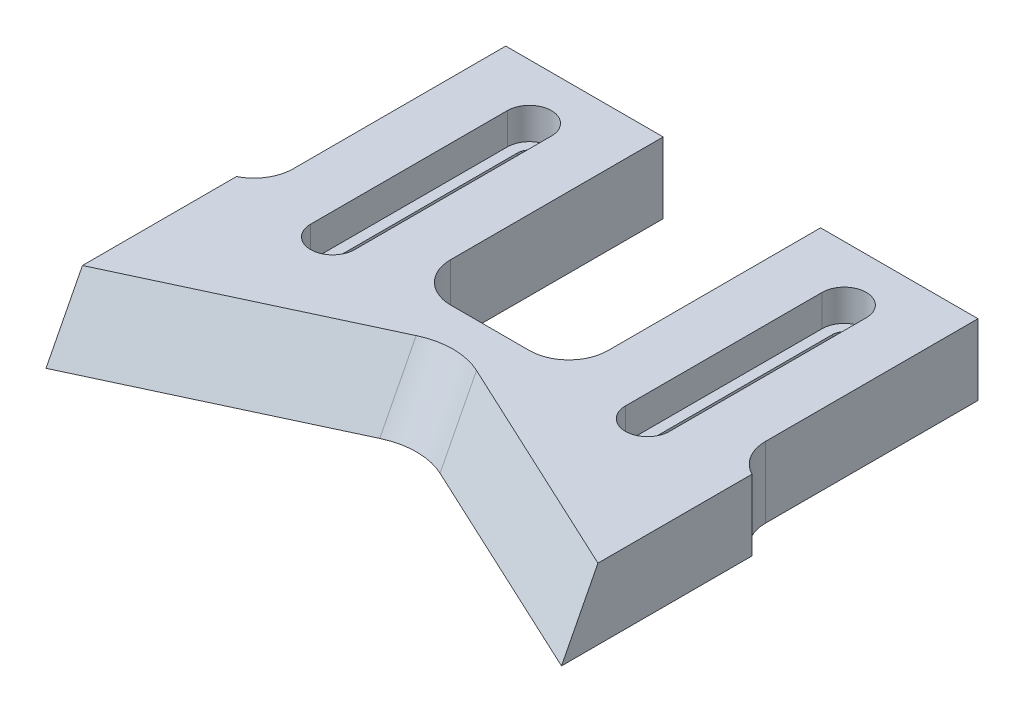
ISO-10303-21;
HEADER;
FILE_DESCRIPTION(('STEP AP214'),'2;1');
FILE_NAME('part.step','',(''),(''),'','','');
FILE_SCHEMA(('AUTOMOTIVE_DESIGN { 1 0 10303 214 1 1 1 1 }'));
ENDSEC;
DATA;
#1=APPLICATION_CONTEXT('core data for automotive mechanical design processes');
#2=APPLICATION_PROTOCOL_DEFINITION('international standard','automotive_design',2000,#1);
#3=PRODUCT_CONTEXT('',#1,'mechanical');
#4=PRODUCT('Part','Part','',(#3));
#5=PRODUCT_RELATED_PRODUCT_CATEGORY('part','',(#4));
#6=PRODUCT_DEFINITION_FORMATION('','',#4);
#7=PRODUCT_DEFINITION_CONTEXT('part definition',#1,'design');
#8=PRODUCT_DEFINITION('design','',#6,#7);
#9=PRODUCT_DEFINITION_SHAPE('','',#8);
#10=(LENGTH_UNIT() NAMED_UNIT(*) SI_UNIT(.MILLI.,.METRE.));
#11=(NAMED_UNIT(*) PLANE_ANGLE_UNIT() SI_UNIT($,.RADIAN.));
#12=(NAMED_UNIT(*) SI_UNIT($,.STERADIAN.) SOLID_ANGLE_UNIT());
#13=UNCERTAINTY_MEASURE_WITH_UNIT(LENGTH_MEASURE(1.E-05),#10,'distance_accuracy_value','');
#14=(GEOMETRIC_REPRESENTATION_CONTEXT(3) GLOBAL_UNCERTAINTY_ASSIGNED_CONTEXT((#13)) GLOBAL_UNIT_ASSIGNED_CONTEXT((#10,
#11,#12)) REPRESENTATION_CONTEXT('',''));
#15=CARTESIAN_POINT('',(0.,0.,0.));
#16=DIRECTION('',(0.,0.,1.));
#17=DIRECTION('',(1.,0.,0.));
#18=AXIS2_PLACEMENT_3D('',#15,#16,#17);
#19=CARTESIAN_POINT('',(57.75,-0.000999999999999265,-51.));
#20=DIRECTION('',(0.,1.,0.));
#21=DIRECTION('',(0.,0.,1.));
#22=AXIS2_PLACEMENT_3D('',#19,#20,#21);
#23=CYLINDRICAL_SURFACE('',#22,1.5);
#24=CARTESIAN_POINT('',(57.75,5.,-51.));
#25=DIRECTION('',(0.,1.,0.));
#26=DIRECTION('',(0.,0.,1.));
#27=AXIS2_PLACEMENT_3D('',#24,#25,#26);
#28=CIRCLE('',#27,1.5);
#29=CARTESIAN_POINT('',(56.25,5.,-51.));
#30=VERTEX_POINT('',#29);
#31=CARTESIAN_POINT('',(59.25,5.,-51.));
#32=VERTEX_POINT('',#31);
#33=EDGE_CURVE('E388',#30,#32,#28,.F.);
#34=ORIENTED_EDGE('',*,*,#33,.F.);
#35=DIRECTION('',(0.,1.,0.));
#36=VECTOR('',#35,1.);
#37=CARTESIAN_POINT('',(56.25,-0.000999999999999265,-51.));
#38=LINE('',#37,#36);
#39=CARTESIAN_POINT('',(56.25,0.,-51.));
#40=VERTEX_POINT('',#39);
#41=EDGE_CURVE('E460',#40,#30,#38,.T.);
#42=ORIENTED_EDGE('',*,*,#41,.F.);
#43=CARTESIAN_POINT('',(57.75,0.,-51.));
#44=DIRECTION('',(0.,-1.,0.));
#45=DIRECTION('',(0.,0.,-1.));
#46=AXIS2_PLACEMENT_3D('',#43,#44,#45);
#47=CIRCLE('',#46,1.5);
#48=CARTESIAN_POINT('',(59.25,0.,-51.));
#49=VERTEX_POINT('',#48);
#50=EDGE_CURVE('E457',#49,#40,#47,.F.);
#51=ORIENTED_EDGE('',*,*,#50,.F.);
#52=DIRECTION('',(0.,1.,0.));
#53=VECTOR('',#52,1.);
#54=CARTESIAN_POINT('',(59.25,-0.000999999999999265,-51.));
#55=LINE('',#54,#53);
#56=EDGE_CURVE('E461',#49,#32,#55,.T.);
#57=ORIENTED_EDGE('',*,*,#56,.T.);
#58=EDGE_LOOP('',(#34,#42,#51,#57));
#59=FACE_BOUND('',#58,.T.);
#60=ADVANCED_FACE('F37',(#59),#23,.F.);
#61=CARTESIAN_POINT('',(59.25,-0.000999999999999265,-51.));
#62=DIRECTION('',(1.,0.,0.));
#63=DIRECTION('',(0.,0.,-1.));
#64=AXIS2_PLACEMENT_3D('',#61,#62,#63);
#65=PLANE('',#64);
#66=DIRECTION('',(0.,0.,1.));
#67=VECTOR('',#66,1.);
#68=CARTESIAN_POINT('',(59.25,5.,-51.));
#69=LINE('',#68,#67);
#70=CARTESIAN_POINT('',(59.25,5.,-26.));
#71=VERTEX_POINT('',#70);
#72=EDGE_CURVE('E386',#32,#71,#69,.T.);
#73=ORIENTED_EDGE('',*,*,#72,.F.);
#74=ORIENTED_EDGE('',*,*,#56,.F.);
#75=DIRECTION('',(0.,0.,-1.));
#76=VECTOR('',#75,1.);
#77=CARTESIAN_POINT('',(59.25,0.,-51.));
#78=LINE('',#77,#76);
#79=CARTESIAN_POINT('',(59.25,0.,-26.));
#80=VERTEX_POINT('',#79);
#81=EDGE_CURVE('E454',#80,#49,#78,.T.);
#82=ORIENTED_EDGE('',*,*,#81,.F.);
#83=DIRECTION('',(0.,1.,0.));
#84=VECTOR('',#83,1.);
#85=CARTESIAN_POINT('',(59.25,-0.000999999999999265,-26.));
#86=LINE('',#85,#84);
#87=EDGE_CURVE('E465',#80,#71,#86,.T.);
#88=ORIENTED_EDGE('',*,*,#87,.T.);
#89=EDGE_LOOP('',(#73,#74,#82,#88));
#90=FACE_BOUND('',#89,.T.);
#91=ADVANCED_FACE('F530',(#90),#65,.F.);
#92=CARTESIAN_POINT('',(57.75,-0.000999999999999265,-26.));
#93=DIRECTION('',(0.,1.,0.));
#94=DIRECTION('',(0.,0.,1.));
#95=AXIS2_PLACEMENT_3D('',#92,#93,#94);
#96=CYLINDRICAL_SURFACE('',#95,1.5);
#97=CARTESIAN_POINT('',(57.75,5.,-26.));
#98=DIRECTION('',(0.,1.,0.));
#99=DIRECTION('',(0.,0.,1.));
#100=AXIS2_PLACEMENT_3D('',#97,#98,#99);
#101=CIRCLE('',#100,1.5);
#102=CARTESIAN_POINT('',(56.25,5.,-26.));
#103=VERTEX_POINT('',#102);
#104=EDGE_CURVE('E378',#71,#103,#101,.F.);
#105=ORIENTED_EDGE('',*,*,#104,.F.);
#106=ORIENTED_EDGE('',*,*,#87,.F.);
#107=CARTESIAN_POINT('',(57.75,0.,-26.));
#108=DIRECTION('',(0.,-1.,0.));
#109=DIRECTION('',(0.,0.,-1.));
#110=AXIS2_PLACEMENT_3D('',#107,#108,#109);
#111=CIRCLE('',#110,1.5);
#112=CARTESIAN_POINT('',(56.25,0.,-26.));
#113=VERTEX_POINT('',#112);
#114=EDGE_CURVE('E449',#113,#80,#111,.F.);
#115=ORIENTED_EDGE('',*,*,#114,.F.);
#116=DIRECTION('',(0.,1.,0.));
#117=VECTOR('',#116,1.);
#118=CARTESIAN_POINT('',(56.25,-0.000999999999999265,-26.));
#119=LINE('',#118,#117);
#120=EDGE_CURVE('E468',#113,#103,#119,.T.);
#121=ORIENTED_EDGE('',*,*,#120,.T.);
#122=EDGE_LOOP('',(#105,#106,#115,#121));
#123=FACE_BOUND('',#122,.T.);
#124=ADVANCED_FACE('F536',(#123),#96,.F.);
#125=CARTESIAN_POINT('',(56.25,-0.000999999999999265,-51.));
#126=DIRECTION('',(-1.,0.,0.));
#127=DIRECTION('',(0.,0.,1.));
#128=AXIS2_PLACEMENT_3D('',#125,#126,#127);
#129=PLANE('',#128);
#130=DIRECTION('',(0.,0.,-1.));
#131=VECTOR('',#130,1.);
#132=CARTESIAN_POINT('',(56.25,5.,-51.));
#133=LINE('',#132,#131);
#134=EDGE_CURVE('E327',#103,#30,#133,.T.);
#135=ORIENTED_EDGE('',*,*,#134,.F.);
#136=ORIENTED_EDGE('',*,*,#120,.F.);
#137=DIRECTION('',(0.,0.,1.));
#138=VECTOR('',#137,1.);
#139=CARTESIAN_POINT('',(56.25,0.,-51.));
#140=LINE('',#139,#138);
#141=EDGE_CURVE('E464',#40,#113,#140,.T.);
#142=ORIENTED_EDGE('',*,*,#141,.F.);
#143=ORIENTED_EDGE('',*,*,#41,.T.);
#144=EDGE_LOOP('',(#135,#136,#142,#143));
#145=FACE_BOUND('',#144,.T.);
#146=ADVANCED_FACE('F542',(#145),#129,.F.);
#147=CARTESIAN_POINT('',(17.75,-0.000999999999999265,-51.));
#148=DIRECTION('',(0.,1.,0.));
#149=DIRECTION('',(0.,0.,1.));
#150=AXIS2_PLACEMENT_3D('',#147,#148,#149);
#151=CYLINDRICAL_SURFACE('',#150,1.5);
#152=CARTESIAN_POINT('',(17.75,5.,-51.));
#153=DIRECTION('',(0.,1.,0.));
#154=DIRECTION('',(0.,0.,1.));
#155=AXIS2_PLACEMENT_3D('',#152,#153,#154);
#156=CIRCLE('',#155,1.5);
#157=CARTESIAN_POINT('',(16.25,5.,-51.));
#158=VERTEX_POINT('',#157);
#159=CARTESIAN_POINT('',(19.25,5.,-51.));
#160=VERTEX_POINT('',#159);
#161=EDGE_CURVE('E426',#158,#160,#156,.F.);
#162=ORIENTED_EDGE('',*,*,#161,.F.);
#163=DIRECTION('',(0.,1.,0.));
#164=VECTOR('',#163,1.);
#165=CARTESIAN_POINT('',(16.25,-0.000999999999999265,-51.));
#166=LINE('',#165,#164);
#167=CARTESIAN_POINT('',(16.25,0.,-51.));
#168=VERTEX_POINT('',#167);
#169=EDGE_CURVE('E484',#168,#158,#166,.T.);
#170=ORIENTED_EDGE('',*,*,#169,.F.);
#171=CARTESIAN_POINT('',(17.75,0.,-51.));
#172=DIRECTION('',(0.,-1.,0.));
#173=DIRECTION('',(0.,0.,-1.));
#174=AXIS2_PLACEMENT_3D('',#171,#172,#173);
#175=CIRCLE('',#174,1.5);
#176=CARTESIAN_POINT('',(19.25,0.,-51.));
#177=VERTEX_POINT('',#176);
#178=EDGE_CURVE('E481',#177,#168,#175,.F.);
#179=ORIENTED_EDGE('',*,*,#178,.F.);
#180=DIRECTION('',(0.,1.,0.));
#181=VECTOR('',#180,1.);
#182=CARTESIAN_POINT('',(19.25,-0.000999999999999265,-51.));
#183=LINE('',#182,#181);
#184=EDGE_CURVE('E485',#177,#160,#183,.T.);
#185=ORIENTED_EDGE('',*,*,#184,.T.);
#186=EDGE_LOOP('',(#162,#170,#179,#185));
#187=FACE_BOUND('',#186,.T.);
#188=ADVANCED_FACE('F548',(#187),#151,.F.);
#189=CARTESIAN_POINT('',(19.25,-0.000999999999999265,-51.));
#190=DIRECTION('',(1.,0.,0.));
#191=DIRECTION('',(0.,0.,-1.));
#192=AXIS2_PLACEMENT_3D('',#189,#190,#191);
#193=PLANE('',#192);
#194=DIRECTION('',(0.,0.,1.));
#195=VECTOR('',#194,1.);
#196=CARTESIAN_POINT('',(19.25,5.,-51.));
#197=LINE('',#196,#195);
#198=CARTESIAN_POINT('',(19.25,5.,-26.));
#199=VERTEX_POINT('',#198);
#200=EDGE_CURVE('E424',#160,#199,#197,.T.);
#201=ORIENTED_EDGE('',*,*,#200,.F.);
#202=ORIENTED_EDGE('',*,*,#184,.F.);
#203=DIRECTION('',(0.,0.,-1.));
#204=VECTOR('',#203,1.);
#205=CARTESIAN_POINT('',(19.25,0.,-51.));
#206=LINE('',#205,#204);
#207=CARTESIAN_POINT('',(19.25,0.,-26.));
#208=VERTEX_POINT('',#207);
#209=EDGE_CURVE('E478',#208,#177,#206,.T.);
#210=ORIENTED_EDGE('',*,*,#209,.F.);
#211=DIRECTION('',(0.,1.,0.));
#212=VECTOR('',#211,1.);
#213=CARTESIAN_POINT('',(19.25,-0.000999999999999265,-26.));
#214=LINE('',#213,#212);
#215=EDGE_CURVE('E488',#208,#199,#214,.T.);
#216=ORIENTED_EDGE('',*,*,#215,.T.);
#217=EDGE_LOOP('',(#201,#202,#210,#216));
#218=FACE_BOUND('',#217,.T.);
#219=ADVANCED_FACE('F544',(#218),#193,.F.);
#220=CARTESIAN_POINT('',(17.75,-0.000999999999999265,-26.));
#221=DIRECTION('',(0.,1.,0.));
#222=DIRECTION('',(0.,0.,1.));
#223=AXIS2_PLACEMENT_3D('',#220,#221,#222);
#224=CYLINDRICAL_SURFACE('',#223,1.5);
#225=CARTESIAN_POINT('',(17.75,5.,-26.));
#226=DIRECTION('',(0.,1.,0.));
#227=DIRECTION('',(0.,0.,1.));
#228=AXIS2_PLACEMENT_3D('',#225,#226,#227);
#229=CIRCLE('',#228,1.5);
#230=CARTESIAN_POINT('',(16.25,5.,-26.));
#231=VERTEX_POINT('',#230);
#232=EDGE_CURVE('E416',#199,#231,#229,.F.);
#233=ORIENTED_EDGE('',*,*,#232,.F.);
#234=ORIENTED_EDGE('',*,*,#215,.F.);
#235=CARTESIAN_POINT('',(17.75,0.,-26.));
#236=DIRECTION('',(0.,-1.,0.));
#237=DIRECTION('',(0.,0.,-1.));
#238=AXIS2_PLACEMENT_3D('',#235,#236,#237);
#239=CIRCLE('',#238,1.5);
#240=CARTESIAN_POINT('',(16.25,0.,-26.));
#241=VERTEX_POINT('',#240);
#242=EDGE_CURVE('E475',#241,#208,#239,.F.);
#243=ORIENTED_EDGE('',*,*,#242,.F.);
#244=DIRECTION('',(0.,1.,0.));
#245=VECTOR('',#244,1.);
#246=CARTESIAN_POINT('',(16.25,-0.000999999999999265,-26.));
#247=LINE('',#246,#245);
#248=EDGE_CURVE('E491',#241,#231,#247,.T.);
#249=ORIENTED_EDGE('',*,*,#248,.T.);
#250=EDGE_LOOP('',(#233,#234,#243,#249));
#251=FACE_BOUND('',#250,.T.);
#252=ADVANCED_FACE('F547',(#251),#224,.F.);
#253=CARTESIAN_POINT('',(16.25,-0.000999999999999265,-51.));
#254=DIRECTION('',(-1.,0.,0.));
#255=DIRECTION('',(0.,0.,1.));
#256=AXIS2_PLACEMENT_3D('',#253,#254,#255);
#257=PLANE('',#256);
#258=DIRECTION('',(0.,0.,-1.));
#259=VECTOR('',#258,1.);
#260=CARTESIAN_POINT('',(16.25,5.,-51.));
#261=LINE('',#260,#259);
#262=EDGE_CURVE('E325',#231,#158,#261,.T.);
#263=ORIENTED_EDGE('',*,*,#262,.F.);
#264=ORIENTED_EDGE('',*,*,#248,.F.);
#265=DIRECTION('',(0.,0.,1.));
#266=VECTOR('',#265,1.);
#267=CARTESIAN_POINT('',(16.25,0.,-51.));
#268=LINE('',#267,#266);
#269=EDGE_CURVE('E275',#168,#241,#268,.T.);
#270=ORIENTED_EDGE('',*,*,#269,.F.);
#271=ORIENTED_EDGE('',*,*,#169,.T.);
#272=EDGE_LOOP('',(#263,#264,#270,#271));
#273=FACE_BOUND('',#272,.T.);
#274=ADVANCED_FACE('F552',(#273),#257,.F.);
#275=CARTESIAN_POINT('',(0.,9.,-58.));
#276=DIRECTION('',(0.,0.,1.));
#277=DIRECTION('',(1.,0.,0.));
#278=AXIS2_PLACEMENT_3D('',#275,#276,#277);
#279=PLANE('',#278);
#280=DIRECTION('',(-1.,0.,0.));
#281=VECTOR('',#280,1.);
#282=CARTESIAN_POINT('',(0.,0.,-58.));
#283=LINE('',#282,#281);
#284=CARTESIAN_POINT('',(27.75,0.,-58.));
#285=VERTEX_POINT('',#284);
#286=CARTESIAN_POINT('',(7.74999999999999,0.,-58.));
#287=VERTEX_POINT('',#286);
#288=EDGE_CURVE('E269',#285,#287,#283,.T.);
#289=ORIENTED_EDGE('',*,*,#288,.T.);
#290=DIRECTION('',(0.,1.,0.));
#291=VECTOR('',#290,1.);
#292=CARTESIAN_POINT('',(7.74999999999999,-1.,-58.));
#293=LINE('',#292,#291);
#294=CARTESIAN_POINT('',(7.74999999999999,9.,-58.));
#295=VERTEX_POINT('',#294);
#296=EDGE_CURVE('E435',#287,#295,#293,.T.);
#297=ORIENTED_EDGE('',*,*,#296,.T.);
#298=DIRECTION('',(-1.,0.,0.));
#299=VECTOR('',#298,1.);
#300=CARTESIAN_POINT('',(0.,9.,-58.));
#301=LINE('',#300,#299);
#302=CARTESIAN_POINT('',(27.75,9.,-58.));
#303=VERTEX_POINT('',#302);
#304=EDGE_CURVE('E279',#303,#295,#301,.T.);
#305=ORIENTED_EDGE('',*,*,#304,.F.);
#306=DIRECTION('',(0.,1.,0.));
#307=VECTOR('',#306,1.);
#308=CARTESIAN_POINT('',(27.75,-1.,-58.));
#309=LINE('',#308,#307);
#310=EDGE_CURVE('E447',#285,#303,#309,.T.);
#311=ORIENTED_EDGE('',*,*,#310,.F.);
#312=EDGE_LOOP('',(#289,#297,#305,#311));
#313=FACE_BOUND('',#312,.T.);
#314=ADVANCED_FACE('F509',(#313),#279,.F.);
#315=CARTESIAN_POINT('',(67.75,9.,-58.));
#316=VERTEX_POINT('',#315);
#317=CARTESIAN_POINT('',(47.75,9.,-58.));
#318=VERTEX_POINT('',#317);
#319=EDGE_CURVE('E284',#316,#318,#301,.T.);
#320=ORIENTED_EDGE('',*,*,#319,.F.);
#321=DIRECTION('',(0.,1.,0.));
#322=VECTOR('',#321,1.);
#323=CARTESIAN_POINT('',(67.75,-1.,-58.));
#324=LINE('',#323,#322);
#325=CARTESIAN_POINT('',(67.75,0.,-58.));
#326=VERTEX_POINT('',#325);
#327=EDGE_CURVE('E431',#326,#316,#324,.T.);
#328=ORIENTED_EDGE('',*,*,#327,.F.);
#329=CARTESIAN_POINT('',(47.75,0.,-58.));
#330=VERTEX_POINT('',#329);
#331=EDGE_CURVE('E273',#326,#330,#283,.T.);
#332=ORIENTED_EDGE('',*,*,#331,.T.);
#333=DIRECTION('',(0.,1.,0.));
#334=VECTOR('',#333,1.);
#335=CARTESIAN_POINT('',(47.75,-1.,-58.));
#336=LINE('',#335,#334);
#337=EDGE_CURVE('E446',#330,#318,#336,.T.);
#338=ORIENTED_EDGE('',*,*,#337,.T.);
#339=EDGE_LOOP('',(#320,#328,#332,#338));
#340=FACE_BOUND('',#339,.T.);
#341=ADVANCED_FACE('F562',(#340),#279,.F.);
#342=CARTESIAN_POINT('',(0.,9.,0.));
#343=DIRECTION('',(0.,-1.,0.));
#344=DIRECTION('',(0.,0.,-1.));
#345=AXIS2_PLACEMENT_3D('',#342,#343,#344);
#346=PLANE('',#345);
#347=DIRECTION('',(0.,0.,1.));
#348=VECTOR('',#347,1.);
#349=CARTESIAN_POINT('',(54.95,9.,-51.));
#350=LINE('',#349,#348);
#351=CARTESIAN_POINT('',(54.95,9.,-51.));
#352=VERTEX_POINT('',#351);
#353=CARTESIAN_POINT('',(54.95,9.,-26.));
#354=VERTEX_POINT('',#353);
#355=EDGE_CURVE('E368',#352,#354,#350,.T.);
#356=ORIENTED_EDGE('',*,*,#355,.F.);
#357=CARTESIAN_POINT('',(57.75,9.,-51.));
#358=DIRECTION('',(0.,1.,0.));
#359=DIRECTION('',(0.,0.,1.));
#360=AXIS2_PLACEMENT_3D('',#357,#358,#359);
#361=CIRCLE('',#360,2.8);
#362=CARTESIAN_POINT('',(60.55,9.,-51.));
#363=VERTEX_POINT('',#362);
#364=EDGE_CURVE('E352',#363,#352,#361,.T.);
#365=ORIENTED_EDGE('',*,*,#364,.F.);
#366=DIRECTION('',(0.,0.,-1.));
#367=VECTOR('',#366,1.);
#368=CARTESIAN_POINT('',(60.55,9.,-51.));
#369=LINE('',#368,#367);
#370=CARTESIAN_POINT('',(60.55,9.,-26.));
#371=VERTEX_POINT('',#370);
#372=EDGE_CURVE('E357',#371,#363,#369,.T.);
#373=ORIENTED_EDGE('',*,*,#372,.F.);
#374=CARTESIAN_POINT('',(57.75,9.,-26.));
#375=DIRECTION('',(0.,1.,0.));
#376=DIRECTION('',(0.,0.,1.));
#377=AXIS2_PLACEMENT_3D('',#374,#375,#376);
#378=CIRCLE('',#377,2.79999999999999);
#379=EDGE_CURVE('E371',#354,#371,#378,.T.);
#380=ORIENTED_EDGE('',*,*,#379,.F.);
#381=EDGE_LOOP('',(#356,#365,#373,#380));
#382=FACE_BOUND('',#381,.T.);
#383=DIRECTION('',(0.,0.,1.));
#384=VECTOR('',#383,1.);
#385=CARTESIAN_POINT('',(14.95,9.,-51.));
#386=LINE('',#385,#384);
#387=CARTESIAN_POINT('',(14.95,9.,-51.));
#388=VERTEX_POINT('',#387);
#389=CARTESIAN_POINT('',(14.95,9.,-26.));
#390=VERTEX_POINT('',#389);
#391=EDGE_CURVE('E406',#388,#390,#386,.T.);
#392=ORIENTED_EDGE('',*,*,#391,.F.);
#393=CARTESIAN_POINT('',(17.75,9.,-51.));
#394=DIRECTION('',(0.,1.,0.));
#395=DIRECTION('',(0.,0.,1.));
#396=AXIS2_PLACEMENT_3D('',#393,#394,#395);
#397=CIRCLE('',#396,2.8);
#398=CARTESIAN_POINT('',(20.55,9.,-51.));
#399=VERTEX_POINT('',#398);
#400=EDGE_CURVE('E390',#399,#388,#397,.T.);
#401=ORIENTED_EDGE('',*,*,#400,.F.);
#402=DIRECTION('',(0.,0.,-1.));
#403=VECTOR('',#402,1.);
#404=CARTESIAN_POINT('',(20.55,9.,-51.));
#405=LINE('',#404,#403);
#406=CARTESIAN_POINT('',(20.55,9.,-26.));
#407=VERTEX_POINT('',#406);
#408=EDGE_CURVE('E395',#407,#399,#405,.T.);
#409=ORIENTED_EDGE('',*,*,#408,.F.);
#410=CARTESIAN_POINT('',(17.75,9.,-26.));
#411=DIRECTION('',(0.,1.,0.));
#412=DIRECTION('',(0.,0.,1.));
#413=AXIS2_PLACEMENT_3D('',#410,#411,#412);
#414=CIRCLE('',#413,2.8);
#415=EDGE_CURVE('E409',#390,#407,#414,.T.);
#416=ORIENTED_EDGE('',*,*,#415,.F.);
#417=EDGE_LOOP('',(#392,#401,#409,#416));
#418=FACE_BOUND('',#417,.T.);
#419=DIRECTION('',(0.906307787036648,0.,0.422618261740704));
#420=VECTOR('',#419,1.);
#421=CARTESIAN_POINT('',(15.258398921666,9.,-32.721742083408));
#422=LINE('',#421,#420);
#423=CARTESIAN_POINT('',(41.5802222155949,9.,-20.4476743048461));
#424=VERTEX_POINT('',#423);
#425=CARTESIAN_POINT('',(70.5,9.,-6.96216045183706));
#426=VERTEX_POINT('',#425);
#427=EDGE_CURVE('E331',#424,#426,#422,.T.);
#428=ORIENTED_EDGE('',*,*,#427,.T.);
#429=DIRECTION('',(0.,0.,1.));
#430=VECTOR('',#429,1.);
#431=CARTESIAN_POINT('',(70.5,9.,0.));
#432=LINE('',#431,#430);
#433=CARTESIAN_POINT('',(70.5,9.,-26.5348572251271));
#434=VERTEX_POINT('',#433);
#435=EDGE_CURVE('E52',#434,#426,#432,.T.);
#436=ORIENTED_EDGE('',*,*,#435,.F.);
#437=CARTESIAN_POINT('',(72.75,9.,-31.));
#438=DIRECTION('',(0.,-1.,0.));
#439=DIRECTION('',(0.,0.,-1.));
#440=AXIS2_PLACEMENT_3D('',#437,#438,#439);
#441=CIRCLE('',#440,5.);
#442=CARTESIAN_POINT('',(67.75,9.,-31.));
#443=VERTEX_POINT('',#442);
#444=EDGE_CURVE('E309',#434,#443,#441,.T.);
#445=ORIENTED_EDGE('',*,*,#444,.T.);
#446=DIRECTION('',(0.,0.,1.));
#447=VECTOR('',#446,1.);
#448=CARTESIAN_POINT('',(67.75,9.,-58.));
#449=LINE('',#448,#447);
#450=EDGE_CURVE('E428',#316,#443,#449,.T.);
#451=ORIENTED_EDGE('',*,*,#450,.F.);
#452=ORIENTED_EDGE('',*,*,#319,.T.);
#453=DIRECTION('',(0.,0.,-1.));
#454=VECTOR('',#453,1.);
#455=CARTESIAN_POINT('',(47.75,9.,-58.));
#456=LINE('',#455,#454);
#457=CARTESIAN_POINT('',(47.75,9.,-31.));
#458=VERTEX_POINT('',#457);
#459=EDGE_CURVE('E444',#458,#318,#456,.T.);
#460=ORIENTED_EDGE('',*,*,#459,.F.);
#461=CARTESIAN_POINT('',(42.75,9.,-31.));
#462=DIRECTION('',(0.,-1.,0.));
#463=DIRECTION('',(0.,0.,-1.));
#464=AXIS2_PLACEMENT_3D('',#461,#462,#463);
#465=CIRCLE('',#464,5.);
#466=CARTESIAN_POINT('',(42.75,9.,-26.));
#467=VERTEX_POINT('',#466);
#468=EDGE_CURVE('E312',#458,#467,#465,.T.);
#469=ORIENTED_EDGE('',*,*,#468,.T.);
#470=DIRECTION('',(1.,0.,0.));
#471=VECTOR('',#470,1.);
#472=CARTESIAN_POINT('',(27.75,9.,-26.));
#473=LINE('',#472,#471);
#474=CARTESIAN_POINT('',(32.75,9.,-26.));
#475=VERTEX_POINT('',#474);
#476=EDGE_CURVE('E441',#475,#467,#473,.T.);
#477=ORIENTED_EDGE('',*,*,#476,.F.);
#478=CARTESIAN_POINT('',(32.75,9.,-31.));
#479=DIRECTION('',(0.,-1.,0.));
#480=DIRECTION('',(0.,0.,-1.));
#481=AXIS2_PLACEMENT_3D('',#478,#479,#480);
#482=CIRCLE('',#481,5.);
#483=CARTESIAN_POINT('',(27.75,9.,-31.));
#484=VERTEX_POINT('',#483);
#485=EDGE_CURVE('E316',#475,#484,#482,.T.);
#486=ORIENTED_EDGE('',*,*,#485,.T.);
#487=DIRECTION('',(0.,0.,1.));
#488=VECTOR('',#487,1.);
#489=CARTESIAN_POINT('',(27.75,9.,-58.));
#490=LINE('',#489,#488);
#491=EDGE_CURVE('E438',#303,#484,#490,.T.);
#492=ORIENTED_EDGE('',*,*,#491,.F.);
#493=ORIENTED_EDGE('',*,*,#304,.T.);
#494=DIRECTION('',(0.,0.,-1.));
#495=VECTOR('',#494,1.);
#496=CARTESIAN_POINT('',(7.74999999999999,9.,-58.));
#497=LINE('',#496,#495);
#498=CARTESIAN_POINT('',(7.74999999999999,9.,-31.));
#499=VERTEX_POINT('',#498);
#500=EDGE_CURVE('E433',#499,#295,#497,.T.);
#501=ORIENTED_EDGE('',*,*,#500,.F.);
#502=CARTESIAN_POINT('',(2.74999999999999,9.,-31.));
#503=DIRECTION('',(0.,-1.,0.));
#504=DIRECTION('',(0.,0.,-1.));
#505=AXIS2_PLACEMENT_3D('',#502,#503,#504);
#506=CIRCLE('',#505,5.);
#507=CARTESIAN_POINT('',(5.,9.,-26.5348572251271));
#508=VERTEX_POINT('',#507);
#509=EDGE_CURVE('E320',#499,#508,#506,.T.);
#510=ORIENTED_EDGE('',*,*,#509,.T.);
#511=DIRECTION('',(0.,0.,-1.));
#512=VECTOR('',#511,1.);
#513=CARTESIAN_POINT('',(5.,9.,0.));
#514=LINE('',#513,#512);
#515=CARTESIAN_POINT('',(5.,9.,-6.96216045183706));
#516=VERTEX_POINT('',#515);
#517=EDGE_CURVE('E350',#516,#508,#514,.T.);
#518=ORIENTED_EDGE('',*,*,#517,.F.);
#519=DIRECTION('',(0.906307787036648,0.,-0.422618261740704));
#520=VECTOR('',#519,1.);
#521=CARTESIAN_POINT('',(-1.7736311873326,9.,-3.80356435566629));
#522=LINE('',#521,#520);
#523=CARTESIAN_POINT('',(33.9197777844051,9.,-20.4476743048461));
#524=VERTEX_POINT('',#523);
#525=EDGE_CURVE('E329',#516,#524,#522,.T.);
#526=ORIENTED_EDGE('',*,*,#525,.T.);
#527=CARTESIAN_POINT('',(37.75,9.,-10.0593079358735));
#528=DIRECTION('',(0.,-1.,0.));
#529=DIRECTION('',(0.,0.,-1.));
#530=AXIS2_PLACEMENT_3D('',#527,#528,#529);
#531=ELLIPSE('',#530,11.2459958085785,10.);
#532=EDGE_CURVE('E11',#524,#424,#531,.T.);
#533=ORIENTED_EDGE('',*,*,#532,.T.);
#534=EDGE_LOOP('',(#428,#436,#445,#451,#452,#460,#469,#477,#486,#492,#493,#501,#510,#518,#526,#533));
#535=FACE_BOUND('',#534,.T.);
#536=ADVANCED_FACE('F506',(#382,#418,#535),#346,.F.);
#537=CARTESIAN_POINT('',(0.,0.,0.));
#538=DIRECTION('',(0.,-1.,0.));
#539=DIRECTION('',(0.,0.,-1.));
#540=AXIS2_PLACEMENT_3D('',#537,#538,#539);
#541=PLANE('',#540);
#542=DIRECTION('',(0.,0.,1.));
#543=VECTOR('',#542,1.);
#544=CARTESIAN_POINT('',(70.5,0.,0.));
#545=LINE('',#544,#543);
#546=CARTESIAN_POINT('',(70.5,0.,-26.5348572251271));
#547=VERTEX_POINT('',#546);
#548=CARTESIAN_POINT('',(70.5,0.,-2.33153829077504));
#549=VERTEX_POINT('',#548);
#550=EDGE_CURVE('E245',#547,#549,#545,.T.);
#551=ORIENTED_EDGE('',*,*,#550,.T.);
#552=DIRECTION('',(0.906307787036648,0.,0.422618261740704));
#553=VECTOR('',#552,1.);
#554=CARTESIAN_POINT('',(75.5,0.,0.));
#555=LINE('',#554,#553);
#556=CARTESIAN_POINT('',(41.5802222155949,0.,-15.8170521437841));
#557=VERTEX_POINT('',#556);
#558=EDGE_CURVE('E259',#557,#549,#555,.T.);
#559=ORIENTED_EDGE('',*,*,#558,.F.);
#560=CARTESIAN_POINT('',(37.75,0.,-5.42868577481145));
#561=DIRECTION('',(0.,-1.,0.));
#562=DIRECTION('',(0.,0.,-1.));
#563=AXIS2_PLACEMENT_3D('',#560,#561,#562);
#564=ELLIPSE('',#563,11.2459958085785,10.);
#565=CARTESIAN_POINT('',(33.9197777844051,0.,-15.8170521437841));
#566=VERTEX_POINT('',#565);
#567=EDGE_CURVE('E45',#557,#566,#564,.F.);
#568=ORIENTED_EDGE('',*,*,#567,.T.);
#569=DIRECTION('',(0.906307787036648,0.,-0.422618261740704));
#570=VECTOR('',#569,1.);
#571=CARTESIAN_POINT('',(37.75,0.,-17.6031140953514));
#572=LINE('',#571,#570);
#573=CARTESIAN_POINT('',(5.,0.,-2.33153829077504));
#574=VERTEX_POINT('',#573);
#575=EDGE_CURVE('E270',#574,#566,#572,.T.);
#576=ORIENTED_EDGE('',*,*,#575,.F.);
#577=DIRECTION('',(0.,0.,-1.));
#578=VECTOR('',#577,1.);
#579=CARTESIAN_POINT('',(5.,0.,0.));
#580=LINE('',#579,#578);
#581=CARTESIAN_POINT('',(5.,0.,-26.5348572251271));
#582=VERTEX_POINT('',#581);
#583=EDGE_CURVE('E60',#574,#582,#580,.T.);
#584=ORIENTED_EDGE('',*,*,#583,.T.);
#585=CARTESIAN_POINT('',(2.74999999999999,0.,-31.));
#586=DIRECTION('',(0.,-1.,0.));
#587=DIRECTION('',(0.,0.,-1.));
#588=AXIS2_PLACEMENT_3D('',#585,#586,#587);
#589=CIRCLE('',#588,5.);
#590=CARTESIAN_POINT('',(7.74999999999999,0.,-31.));
#591=VERTEX_POINT('',#590);
#592=EDGE_CURVE('E323',#582,#591,#589,.F.);
#593=ORIENTED_EDGE('',*,*,#592,.T.);
#594=DIRECTION('',(0.,0.,1.));
#595=VECTOR('',#594,1.);
#596=CARTESIAN_POINT('',(7.75,0.,0.));
#597=LINE('',#596,#595);
#598=EDGE_CURVE('E289',#287,#591,#597,.T.);
#599=ORIENTED_EDGE('',*,*,#598,.F.);
#600=ORIENTED_EDGE('',*,*,#288,.F.);
#601=DIRECTION('',(0.,0.,-1.));
#602=VECTOR('',#601,1.);
#603=CARTESIAN_POINT('',(27.75,0.,0.));
#604=LINE('',#603,#602);
#605=CARTESIAN_POINT('',(27.75,0.,-31.));
#606=VERTEX_POINT('',#605);
#607=EDGE_CURVE('E287',#606,#285,#604,.T.);
#608=ORIENTED_EDGE('',*,*,#607,.F.);
#609=CARTESIAN_POINT('',(32.75,0.,-31.));
#610=DIRECTION('',(0.,-1.,0.));
#611=DIRECTION('',(0.,0.,-1.));
#612=AXIS2_PLACEMENT_3D('',#609,#610,#611);
#613=CIRCLE('',#612,5.);
#614=CARTESIAN_POINT('',(32.75,0.,-26.));
#615=VERTEX_POINT('',#614);
#616=EDGE_CURVE('E318',#606,#615,#613,.F.);
#617=ORIENTED_EDGE('',*,*,#616,.T.);
#618=DIRECTION('',(-1.,0.,0.));
#619=VECTOR('',#618,1.);
#620=CARTESIAN_POINT('',(0.,0.,-26.));
#621=LINE('',#620,#619);
#622=CARTESIAN_POINT('',(42.75,0.,-26.));
#623=VERTEX_POINT('',#622);
#624=EDGE_CURVE('E280',#623,#615,#621,.T.);
#625=ORIENTED_EDGE('',*,*,#624,.F.);
#626=CARTESIAN_POINT('',(42.75,0.,-31.));
#627=DIRECTION('',(0.,-1.,0.));
#628=DIRECTION('',(0.,0.,-1.));
#629=AXIS2_PLACEMENT_3D('',#626,#627,#628);
#630=CIRCLE('',#629,5.);
#631=CARTESIAN_POINT('',(47.75,0.,-31.));
#632=VERTEX_POINT('',#631);
#633=EDGE_CURVE('E314',#623,#632,#630,.F.);
#634=ORIENTED_EDGE('',*,*,#633,.T.);
#635=DIRECTION('',(0.,0.,1.));
#636=VECTOR('',#635,1.);
#637=CARTESIAN_POINT('',(47.75,0.,0.));
#638=LINE('',#637,#636);
#639=EDGE_CURVE('E283',#330,#632,#638,.T.);
#640=ORIENTED_EDGE('',*,*,#639,.F.);
#641=ORIENTED_EDGE('',*,*,#331,.F.);
#642=DIRECTION('',(0.,0.,-1.));
#643=VECTOR('',#642,1.);
#644=CARTESIAN_POINT('',(67.75,0.,0.));
#645=LINE('',#644,#643);
#646=CARTESIAN_POINT('',(67.75,0.,-31.));
#647=VERTEX_POINT('',#646);
#648=EDGE_CURVE('E292',#647,#326,#645,.T.);
#649=ORIENTED_EDGE('',*,*,#648,.F.);
#650=CARTESIAN_POINT('',(72.75,0.,-31.));
#651=DIRECTION('',(0.,-1.,0.));
#652=DIRECTION('',(0.,0.,-1.));
#653=AXIS2_PLACEMENT_3D('',#650,#651,#652);
#654=CIRCLE('',#653,5.);
#655=EDGE_CURVE('E262',#647,#547,#654,.F.);
#656=ORIENTED_EDGE('',*,*,#655,.T.);
#657=EDGE_LOOP('',(#551,#559,#568,#576,#584,#593,#599,#600,#608,#617,#625,#634,#640,#641,#649,#656));
#658=FACE_BOUND('',#657,.T.);
#659=ORIENTED_EDGE('',*,*,#50,.T.);
#660=ORIENTED_EDGE('',*,*,#141,.T.);
#661=ORIENTED_EDGE('',*,*,#114,.T.);
#662=ORIENTED_EDGE('',*,*,#81,.T.);
#663=EDGE_LOOP('',(#659,#660,#661,#662));
#664=FACE_BOUND('',#663,.T.);
#665=ORIENTED_EDGE('',*,*,#178,.T.);
#666=ORIENTED_EDGE('',*,*,#269,.T.);
#667=ORIENTED_EDGE('',*,*,#242,.T.);
#668=ORIENTED_EDGE('',*,*,#209,.T.);
#669=EDGE_LOOP('',(#665,#666,#667,#668));
#670=FACE_BOUND('',#669,.T.);
#671=ADVANCED_FACE('F256',(#658,#664,#670),#541,.T.);
#672=CARTESIAN_POINT('',(27.75,-1.,-58.));
#673=DIRECTION('',(-1.,0.,0.));
#674=DIRECTION('',(0.,0.,1.));
#675=AXIS2_PLACEMENT_3D('',#672,#673,#674);
#676=PLANE('',#675);
#677=ORIENTED_EDGE('',*,*,#491,.T.);
#678=DIRECTION('',(0.,1.,0.));
#679=VECTOR('',#678,1.);
#680=CARTESIAN_POINT('',(27.75,0.,-31.));
#681=LINE('',#680,#679);
#682=EDGE_CURVE('E304',#484,#606,#681,.F.);
#683=ORIENTED_EDGE('',*,*,#682,.T.);
#684=ORIENTED_EDGE('',*,*,#607,.T.);
#685=ORIENTED_EDGE('',*,*,#310,.T.);
#686=EDGE_LOOP('',(#677,#683,#684,#685));
#687=FACE_BOUND('',#686,.T.);
#688=ADVANCED_FACE('F566',(#687),#676,.F.);
#689=CARTESIAN_POINT('',(47.75,-1.,-58.));
#690=DIRECTION('',(1.,0.,0.));
#691=DIRECTION('',(0.,0.,-1.));
#692=AXIS2_PLACEMENT_3D('',#689,#690,#691);
#693=PLANE('',#692);
#694=ORIENTED_EDGE('',*,*,#639,.T.);
#695=DIRECTION('',(0.,1.,0.));
#696=VECTOR('',#695,1.);
#697=CARTESIAN_POINT('',(47.75,9.,-31.));
#698=LINE('',#697,#696);
#699=EDGE_CURVE('E296',#632,#458,#698,.T.);
#700=ORIENTED_EDGE('',*,*,#699,.T.);
#701=ORIENTED_EDGE('',*,*,#459,.T.);
#702=ORIENTED_EDGE('',*,*,#337,.F.);
#703=EDGE_LOOP('',(#694,#700,#701,#702));
#704=FACE_BOUND('',#703,.T.);
#705=ADVANCED_FACE('F633',(#704),#693,.F.);
#706=CARTESIAN_POINT('',(27.75,-1.,-26.));
#707=DIRECTION('',(0.,0.,1.));
#708=DIRECTION('',(1.,0.,0.));
#709=AXIS2_PLACEMENT_3D('',#706,#707,#708);
#710=PLANE('',#709);
#711=ORIENTED_EDGE('',*,*,#476,.T.);
#712=DIRECTION('',(0.,1.,0.));
#713=VECTOR('',#712,1.);
#714=CARTESIAN_POINT('',(42.75,0.,-26.));
#715=LINE('',#714,#713);
#716=EDGE_CURVE('E302',#467,#623,#715,.F.);
#717=ORIENTED_EDGE('',*,*,#716,.T.);
#718=ORIENTED_EDGE('',*,*,#624,.T.);
#719=DIRECTION('',(0.,1.,0.));
#720=VECTOR('',#719,1.);
#721=CARTESIAN_POINT('',(32.75,9.,-26.));
#722=LINE('',#721,#720);
#723=EDGE_CURVE('E299',#615,#475,#722,.T.);
#724=ORIENTED_EDGE('',*,*,#723,.T.);
#725=EDGE_LOOP('',(#711,#717,#718,#724));
#726=FACE_BOUND('',#725,.T.);
#727=ADVANCED_FACE('F632',(#726),#710,.F.);
#728=CARTESIAN_POINT('',(7.74999999999999,-1.,-58.));
#729=DIRECTION('',(1.,0.,0.));
#730=DIRECTION('',(0.,0.,-1.));
#731=AXIS2_PLACEMENT_3D('',#728,#729,#730);
#732=PLANE('',#731);
#733=ORIENTED_EDGE('',*,*,#598,.T.);
#734=DIRECTION('',(0.,1.,0.));
#735=VECTOR('',#734,1.);
#736=CARTESIAN_POINT('',(7.74999999999999,9.,-31.));
#737=LINE('',#736,#735);
#738=EDGE_CURVE('E306',#591,#499,#737,.T.);
#739=ORIENTED_EDGE('',*,*,#738,.T.);
#740=ORIENTED_EDGE('',*,*,#500,.T.);
#741=ORIENTED_EDGE('',*,*,#296,.F.);
#742=EDGE_LOOP('',(#733,#739,#740,#741));
#743=FACE_BOUND('',#742,.T.);
#744=ADVANCED_FACE('F513',(#743),#732,.F.);
#745=CARTESIAN_POINT('',(67.75,-1.,-58.));
#746=DIRECTION('',(-1.,0.,0.));
#747=DIRECTION('',(0.,0.,1.));
#748=AXIS2_PLACEMENT_3D('',#745,#746,#747);
#749=PLANE('',#748);
#750=ORIENTED_EDGE('',*,*,#450,.T.);
#751=DIRECTION('',(0.,1.,0.));
#752=VECTOR('',#751,1.);
#753=CARTESIAN_POINT('',(67.75,0.,-31.));
#754=LINE('',#753,#752);
#755=EDGE_CURVE('E294',#443,#647,#754,.F.);
#756=ORIENTED_EDGE('',*,*,#755,.T.);
#757=ORIENTED_EDGE('',*,*,#648,.T.);
#758=ORIENTED_EDGE('',*,*,#327,.T.);
#759=EDGE_LOOP('',(#750,#756,#757,#758));
#760=FACE_BOUND('',#759,.T.);
#761=ADVANCED_FACE('F574',(#760),#749,.F.);
#762=CARTESIAN_POINT('',(72.75,-1.,-31.));
#763=DIRECTION('',(0.,-1.,0.));
#764=DIRECTION('',(0.,0.,-1.));
#765=AXIS2_PLACEMENT_3D('',#762,#763,#764);
#766=CYLINDRICAL_SURFACE('',#765,5.);
#767=ORIENTED_EDGE('',*,*,#444,.F.);
#768=DIRECTION('',(0.,-1.,0.));
#769=VECTOR('',#768,1.);
#770=CARTESIAN_POINT('',(70.5,-1.,-26.5348572251271));
#771=LINE('',#770,#769);
#772=EDGE_CURVE('E251',#547,#434,#771,.F.);
#773=ORIENTED_EDGE('',*,*,#772,.F.);
#774=ORIENTED_EDGE('',*,*,#655,.F.);
#775=ORIENTED_EDGE('',*,*,#755,.F.);
#776=EDGE_LOOP('',(#767,#773,#774,#775));
#777=FACE_BOUND('',#776,.T.);
#778=ADVANCED_FACE('F570',(#777),#766,.F.);
#779=CARTESIAN_POINT('',(42.75,-1.,-31.));
#780=DIRECTION('',(0.,-1.,0.));
#781=DIRECTION('',(0.,0.,-1.));
#782=AXIS2_PLACEMENT_3D('',#779,#780,#781);
#783=CYLINDRICAL_SURFACE('',#782,5.);
#784=ORIENTED_EDGE('',*,*,#633,.F.);
#785=ORIENTED_EDGE('',*,*,#716,.F.);
#786=ORIENTED_EDGE('',*,*,#468,.F.);
#787=ORIENTED_EDGE('',*,*,#699,.F.);
#788=EDGE_LOOP('',(#784,#785,#786,#787));
#789=FACE_BOUND('',#788,.T.);
#790=ADVANCED_FACE('F573',(#789),#783,.F.);
#791=CARTESIAN_POINT('',(32.75,-1.,-31.));
#792=DIRECTION('',(0.,-1.,0.));
#793=DIRECTION('',(0.,0.,-1.));
#794=AXIS2_PLACEMENT_3D('',#791,#792,#793);
#795=CYLINDRICAL_SURFACE('',#794,5.);
#796=ORIENTED_EDGE('',*,*,#616,.F.);
#797=ORIENTED_EDGE('',*,*,#682,.F.);
#798=ORIENTED_EDGE('',*,*,#485,.F.);
#799=ORIENTED_EDGE('',*,*,#723,.F.);
#800=EDGE_LOOP('',(#796,#797,#798,#799));
#801=FACE_BOUND('',#800,.T.);
#802=ADVANCED_FACE('F578',(#801),#795,.F.);
#803=CARTESIAN_POINT('',(2.74999999999999,-1.,-31.));
#804=DIRECTION('',(0.,-1.,0.));
#805=DIRECTION('',(0.,0.,-1.));
#806=AXIS2_PLACEMENT_3D('',#803,#804,#805);
#807=CYLINDRICAL_SURFACE('',#806,5.);
#808=ORIENTED_EDGE('',*,*,#592,.F.);
#809=DIRECTION('',(0.,-1.,0.));
#810=VECTOR('',#809,1.);
#811=CARTESIAN_POINT('',(5.,-1.,-26.5348572251271));
#812=LINE('',#811,#810);
#813=EDGE_CURVE('E344',#508,#582,#812,.T.);
#814=ORIENTED_EDGE('',*,*,#813,.F.);
#815=ORIENTED_EDGE('',*,*,#509,.F.);
#816=ORIENTED_EDGE('',*,*,#738,.F.);
#817=EDGE_LOOP('',(#808,#814,#815,#816));
#818=FACE_BOUND('',#817,.T.);
#819=ADVANCED_FACE('F519',(#818),#807,.F.);
#820=CARTESIAN_POINT('',(17.75,5.,-51.));
#821=DIRECTION('',(0.,1.,0.));
#822=DIRECTION('',(0.,0.,1.));
#823=AXIS2_PLACEMENT_3D('',#820,#821,#822);
#824=PLANE('',#823);
#825=CARTESIAN_POINT('',(17.75,5.,-51.));
#826=DIRECTION('',(0.,1.,0.));
#827=DIRECTION('',(0.,0.,1.));
#828=AXIS2_PLACEMENT_3D('',#825,#826,#827);
#829=CIRCLE('',#828,2.8);
#830=CARTESIAN_POINT('',(20.55,5.,-51.));
#831=VERTEX_POINT('',#830);
#832=CARTESIAN_POINT('',(14.95,5.,-51.));
#833=VERTEX_POINT('',#832);
#834=EDGE_CURVE('E391',#831,#833,#829,.T.);
#835=ORIENTED_EDGE('',*,*,#834,.T.);
#836=DIRECTION('',(0.,0.,1.));
#837=VECTOR('',#836,1.);
#838=CARTESIAN_POINT('',(14.95,5.,-51.));
#839=LINE('',#838,#837);
#840=CARTESIAN_POINT('',(14.95,5.,-26.));
#841=VERTEX_POINT('',#840);
#842=EDGE_CURVE('E394',#833,#841,#839,.T.);
#843=ORIENTED_EDGE('',*,*,#842,.T.);
#844=CARTESIAN_POINT('',(17.75,5.,-26.));
#845=DIRECTION('',(0.,1.,0.));
#846=DIRECTION('',(0.,0.,1.));
#847=AXIS2_PLACEMENT_3D('',#844,#845,#846);
#848=CIRCLE('',#847,2.8);
#849=CARTESIAN_POINT('',(20.55,5.,-26.));
#850=VERTEX_POINT('',#849);
#851=EDGE_CURVE('E398',#841,#850,#848,.T.);
#852=ORIENTED_EDGE('',*,*,#851,.T.);
#853=DIRECTION('',(0.,0.,-1.));
#854=VECTOR('',#853,1.);
#855=CARTESIAN_POINT('',(20.55,5.,-51.));
#856=LINE('',#855,#854);
#857=EDGE_CURVE('E401',#850,#831,#856,.T.);
#858=ORIENTED_EDGE('',*,*,#857,.T.);
#859=EDGE_LOOP('',(#835,#843,#852,#858));
#860=FACE_BOUND('',#859,.T.);
#861=ORIENTED_EDGE('',*,*,#161,.T.);
#862=ORIENTED_EDGE('',*,*,#200,.T.);
#863=ORIENTED_EDGE('',*,*,#232,.T.);
#864=ORIENTED_EDGE('',*,*,#262,.T.);
#865=EDGE_LOOP('',(#861,#862,#863,#864));
#866=FACE_BOUND('',#865,.T.);
#867=ADVANCED_FACE('F585',(#860,#866),#824,.T.);
#868=CARTESIAN_POINT('',(17.75,5.,-51.));
#869=DIRECTION('',(0.,1.,0.));
#870=DIRECTION('',(0.,0.,1.));
#871=AXIS2_PLACEMENT_3D('',#868,#869,#870);
#872=CYLINDRICAL_SURFACE('',#871,2.8);
#873=ORIENTED_EDGE('',*,*,#400,.T.);
#874=DIRECTION('',(0.,1.,0.));
#875=VECTOR('',#874,1.);
#876=CARTESIAN_POINT('',(14.95,5.,-51.));
#877=LINE('',#876,#875);
#878=EDGE_CURVE('E404',#833,#388,#877,.T.);
#879=ORIENTED_EDGE('',*,*,#878,.F.);
#880=ORIENTED_EDGE('',*,*,#834,.F.);
#881=DIRECTION('',(0.,1.,0.));
#882=VECTOR('',#881,1.);
#883=CARTESIAN_POINT('',(20.55,5.,-51.));
#884=LINE('',#883,#882);
#885=EDGE_CURVE('E414',#831,#399,#884,.T.);
#886=ORIENTED_EDGE('',*,*,#885,.T.);
#887=EDGE_LOOP('',(#873,#879,#880,#886));
#888=FACE_BOUND('',#887,.T.);
#889=ADVANCED_FACE('F610',(#888),#872,.F.);
#890=CARTESIAN_POINT('',(20.55,5.,-51.));
#891=DIRECTION('',(1.,0.,0.));
#892=DIRECTION('',(0.,0.,-1.));
#893=AXIS2_PLACEMENT_3D('',#890,#891,#892);
#894=PLANE('',#893);
#895=ORIENTED_EDGE('',*,*,#408,.T.);
#896=ORIENTED_EDGE('',*,*,#885,.F.);
#897=ORIENTED_EDGE('',*,*,#857,.F.);
#898=DIRECTION('',(0.,1.,0.));
#899=VECTOR('',#898,1.);
#900=CARTESIAN_POINT('',(20.55,5.,-26.));
#901=LINE('',#900,#899);
#902=EDGE_CURVE('E417',#850,#407,#901,.T.);
#903=ORIENTED_EDGE('',*,*,#902,.T.);
#904=EDGE_LOOP('',(#895,#896,#897,#903));
#905=FACE_BOUND('',#904,.T.);
#906=ADVANCED_FACE('F612',(#905),#894,.F.);
#907=CARTESIAN_POINT('',(17.75,5.,-26.));
#908=DIRECTION('',(0.,1.,0.));
#909=DIRECTION('',(0.,0.,1.));
#910=AXIS2_PLACEMENT_3D('',#907,#908,#909);
#911=CYLINDRICAL_SURFACE('',#910,2.8);
#912=ORIENTED_EDGE('',*,*,#415,.T.);
#913=ORIENTED_EDGE('',*,*,#902,.F.);
#914=ORIENTED_EDGE('',*,*,#851,.F.);
#915=DIRECTION('',(0.,1.,0.));
#916=VECTOR('',#915,1.);
#917=CARTESIAN_POINT('',(14.95,5.,-26.));
#918=LINE('',#917,#916);
#919=EDGE_CURVE('E419',#841,#390,#918,.T.);
#920=ORIENTED_EDGE('',*,*,#919,.T.);
#921=EDGE_LOOP('',(#912,#913,#914,#920));
#922=FACE_BOUND('',#921,.T.);
#923=ADVANCED_FACE('F615',(#922),#911,.F.);
#924=CARTESIAN_POINT('',(14.95,5.,-51.));
#925=DIRECTION('',(-1.,0.,0.));
#926=DIRECTION('',(0.,0.,1.));
#927=AXIS2_PLACEMENT_3D('',#924,#925,#926);
#928=PLANE('',#927);
#929=ORIENTED_EDGE('',*,*,#391,.T.);
#930=ORIENTED_EDGE('',*,*,#919,.F.);
#931=ORIENTED_EDGE('',*,*,#842,.F.);
#932=ORIENTED_EDGE('',*,*,#878,.T.);
#933=EDGE_LOOP('',(#929,#930,#931,#932));
#934=FACE_BOUND('',#933,.T.);
#935=ADVANCED_FACE('F619',(#934),#928,.F.);
#936=CARTESIAN_POINT('',(57.75,5.,-51.));
#937=DIRECTION('',(0.,1.,0.));
#938=DIRECTION('',(0.,0.,1.));
#939=AXIS2_PLACEMENT_3D('',#936,#937,#938);
#940=PLANE('',#939);
#941=CARTESIAN_POINT('',(57.75,5.,-51.));
#942=DIRECTION('',(0.,1.,0.));
#943=DIRECTION('',(0.,0.,1.));
#944=AXIS2_PLACEMENT_3D('',#941,#942,#943);
#945=CIRCLE('',#944,2.8);
#946=CARTESIAN_POINT('',(60.55,5.,-51.));
#947=VERTEX_POINT('',#946);
#948=CARTESIAN_POINT('',(54.95,5.,-51.));
#949=VERTEX_POINT('',#948);
#950=EDGE_CURVE('E353',#947,#949,#945,.T.);
#951=ORIENTED_EDGE('',*,*,#950,.T.);
#952=DIRECTION('',(0.,0.,1.));
#953=VECTOR('',#952,1.);
#954=CARTESIAN_POINT('',(54.95,5.,-51.));
#955=LINE('',#954,#953);
#956=CARTESIAN_POINT('',(54.95,5.,-26.));
#957=VERTEX_POINT('',#956);
#958=EDGE_CURVE('E356',#949,#957,#955,.T.);
#959=ORIENTED_EDGE('',*,*,#958,.T.);
#960=CARTESIAN_POINT('',(57.75,5.,-26.));
#961=DIRECTION('',(0.,1.,0.));
#962=DIRECTION('',(0.,0.,1.));
#963=AXIS2_PLACEMENT_3D('',#960,#961,#962);
#964=CIRCLE('',#963,2.79999999999999);
#965=CARTESIAN_POINT('',(60.55,5.,-26.));
#966=VERTEX_POINT('',#965);
#967=EDGE_CURVE('E360',#957,#966,#964,.T.);
#968=ORIENTED_EDGE('',*,*,#967,.T.);
#969=DIRECTION('',(0.,0.,-1.));
#970=VECTOR('',#969,1.);
#971=CARTESIAN_POINT('',(60.55,5.,-51.));
#972=LINE('',#971,#970);
#973=EDGE_CURVE('E363',#966,#947,#972,.T.);
#974=ORIENTED_EDGE('',*,*,#973,.T.);
#975=EDGE_LOOP('',(#951,#959,#968,#974));
#976=FACE_BOUND('',#975,.T.);
#977=ORIENTED_EDGE('',*,*,#33,.T.);
#978=ORIENTED_EDGE('',*,*,#72,.T.);
#979=ORIENTED_EDGE('',*,*,#104,.T.);
#980=ORIENTED_EDGE('',*,*,#134,.T.);
#981=EDGE_LOOP('',(#977,#978,#979,#980));
#982=FACE_BOUND('',#981,.T.);
#983=ADVANCED_FACE('F606',(#976,#982),#940,.T.);
#984=CARTESIAN_POINT('',(57.75,5.,-51.));
#985=DIRECTION('',(0.,1.,0.));
#986=DIRECTION('',(0.,0.,1.));
#987=AXIS2_PLACEMENT_3D('',#984,#985,#986);
#988=CYLINDRICAL_SURFACE('',#987,2.8);
#989=ORIENTED_EDGE('',*,*,#364,.T.);
#990=DIRECTION('',(0.,1.,0.));
#991=VECTOR('',#990,1.);
#992=CARTESIAN_POINT('',(54.95,5.,-51.));
#993=LINE('',#992,#991);
#994=EDGE_CURVE('E366',#949,#352,#993,.T.);
#995=ORIENTED_EDGE('',*,*,#994,.F.);
#996=ORIENTED_EDGE('',*,*,#950,.F.);
#997=DIRECTION('',(0.,1.,0.));
#998=VECTOR('',#997,1.);
#999=CARTESIAN_POINT('',(60.55,5.,-51.));
#1000=LINE('',#999,#998);
#1001=EDGE_CURVE('E376',#947,#363,#1000,.T.);
#1002=ORIENTED_EDGE('',*,*,#1001,.T.);
#1003=EDGE_LOOP('',(#989,#995,#996,#1002));
#1004=FACE_BOUND('',#1003,.T.);
#1005=ADVANCED_FACE('F603',(#1004),#988,.F.);
#1006=CARTESIAN_POINT('',(60.55,5.,-51.));
#1007=DIRECTION('',(1.,0.,0.));
#1008=DIRECTION('',(0.,0.,-1.));
#1009=AXIS2_PLACEMENT_3D('',#1006,#1007,#1008);
#1010=PLANE('',#1009);
#1011=ORIENTED_EDGE('',*,*,#372,.T.);
#1012=ORIENTED_EDGE('',*,*,#1001,.F.);
#1013=ORIENTED_EDGE('',*,*,#973,.F.);
#1014=DIRECTION('',(0.,1.,0.));
#1015=VECTOR('',#1014,1.);
#1016=CARTESIAN_POINT('',(60.55,5.,-26.));
#1017=LINE('',#1016,#1015);
#1018=EDGE_CURVE('E379',#966,#371,#1017,.T.);
#1019=ORIENTED_EDGE('',*,*,#1018,.T.);
#1020=EDGE_LOOP('',(#1011,#1012,#1013,#1019));
#1021=FACE_BOUND('',#1020,.T.);
#1022=ADVANCED_FACE('F598',(#1021),#1010,.F.);
#1023=CARTESIAN_POINT('',(57.75,5.,-26.));
#1024=DIRECTION('',(0.,1.,0.));
#1025=DIRECTION('',(0.,0.,1.));
#1026=AXIS2_PLACEMENT_3D('',#1023,#1024,#1025);
#1027=CYLINDRICAL_SURFACE('',#1026,2.79999999999999);
#1028=ORIENTED_EDGE('',*,*,#379,.T.);
#1029=ORIENTED_EDGE('',*,*,#1018,.F.);
#1030=ORIENTED_EDGE('',*,*,#967,.F.);
#1031=DIRECTION('',(0.,1.,0.));
#1032=VECTOR('',#1031,1.);
#1033=CARTESIAN_POINT('',(54.95,5.,-26.));
#1034=LINE('',#1033,#1032);
#1035=EDGE_CURVE('E381',#957,#354,#1034,.T.);
#1036=ORIENTED_EDGE('',*,*,#1035,.T.);
#1037=EDGE_LOOP('',(#1028,#1029,#1030,#1036));
#1038=FACE_BOUND('',#1037,.T.);
#1039=ADVANCED_FACE('F592',(#1038),#1027,.F.);
#1040=CARTESIAN_POINT('',(54.95,5.,-51.));
#1041=DIRECTION('',(-1.,0.,0.));
#1042=DIRECTION('',(0.,0.,1.));
#1043=AXIS2_PLACEMENT_3D('',#1040,#1041,#1042);
#1044=PLANE('',#1043);
#1045=ORIENTED_EDGE('',*,*,#355,.T.);
#1046=ORIENTED_EDGE('',*,*,#1035,.F.);
#1047=ORIENTED_EDGE('',*,*,#958,.F.);
#1048=ORIENTED_EDGE('',*,*,#994,.T.);
#1049=EDGE_LOOP('',(#1045,#1046,#1047,#1048));
#1050=FACE_BOUND('',#1049,.T.);
#1051=ADVANCED_FACE('F588',(#1050),#1044,.F.);
#1052=CARTESIAN_POINT('',(-1.7736311873326,9.,-3.80356435566629));
#1053=DIRECTION('',(-0.383022221559493,-0.422618261740698,-0.821393804843269));
#1054=DIRECTION('',(0.906307787036648,0.,-0.422618261740704));
#1055=AXIS2_PLACEMENT_3D('',#1052,#1053,#1054);
#1056=PLANE('',#1055);
#1057=DIRECTION('',(0.,0.88920538209448,-0.45750823867359));
#1058=VECTOR('',#1057,1.);
#1059=CARTESIAN_POINT('',(5.,-0.949304268262537,-1.84310835941869));
#1060=LINE('',#1059,#1058);
#1061=EDGE_CURVE('E263',#516,#574,#1060,.F.);
#1062=ORIENTED_EDGE('',*,*,#1061,.T.);
#1063=ORIENTED_EDGE('',*,*,#575,.T.);
#1064=DIRECTION('',(0.,0.88920538209448,-0.457508238673589));
#1065=VECTOR('',#1064,1.);
#1066=CARTESIAN_POINT('',(33.9197777844051,9.72660355875304,-20.8215216983426));
#1067=LINE('',#1066,#1065);
#1068=EDGE_CURVE('E334',#566,#524,#1067,.T.);
#1069=ORIENTED_EDGE('',*,*,#1068,.T.);
#1070=ORIENTED_EDGE('',*,*,#525,.F.);
#1071=EDGE_LOOP('',(#1062,#1063,#1069,#1070));
#1072=FACE_BOUND('',#1071,.T.);
#1073=ADVANCED_FACE('F342',(#1072),#1056,.F.);
#1074=CARTESIAN_POINT('',(15.258398921666,9.,-32.721742083408));
#1075=DIRECTION('',(0.383022221559494,-0.422618261740697,-0.821393804843269));
#1076=DIRECTION('',(0.906307787036648,0.,0.422618261740704));
#1077=AXIS2_PLACEMENT_3D('',#1074,#1075,#1076);
#1078=PLANE('',#1077);
#1079=DIRECTION('',(0.,-0.88920538209448,0.457508238673589));
#1080=VECTOR('',#1079,1.);
#1081=CARTESIAN_POINT('',(70.5,-0.949304268262536,-1.84310835941869));
#1082=LINE('',#1081,#1080);
#1083=EDGE_CURVE('E242',#549,#426,#1082,.F.);
#1084=ORIENTED_EDGE('',*,*,#1083,.T.);
#1085=ORIENTED_EDGE('',*,*,#427,.F.);
#1086=DIRECTION('',(0.,0.88920538209448,-0.457508238673589));
#1087=VECTOR('',#1086,1.);
#1088=CARTESIAN_POINT('',(41.5802222155949,0.726603558753026,-16.1908995372806));
#1089=LINE('',#1088,#1087);
#1090=EDGE_CURVE('E268',#424,#557,#1089,.F.);
#1091=ORIENTED_EDGE('',*,*,#1090,.T.);
#1092=ORIENTED_EDGE('',*,*,#558,.T.);
#1093=EDGE_LOOP('',(#1084,#1085,#1091,#1092));
#1094=FACE_BOUND('',#1093,.T.);
#1095=ADVANCED_FACE('F266',(#1094),#1078,.F.);
#1096=CARTESIAN_POINT('',(37.75,18.2195039971345,-14.802867882888));
#1097=DIRECTION('',(0.,0.88920538209448,-0.457508238673589));
#1098=DIRECTION('',(0.,0.457508238673589,0.88920538209448));
#1099=AXIS2_PLACEMENT_3D('',#1096,#1097,#1098);
#1100=CYLINDRICAL_SURFACE('',#1099,10.);
#1101=ORIENTED_EDGE('',*,*,#532,.F.);
#1102=ORIENTED_EDGE('',*,*,#1068,.F.);
#1103=ORIENTED_EDGE('',*,*,#567,.F.);
#1104=ORIENTED_EDGE('',*,*,#1090,.F.);
#1105=EDGE_LOOP('',(#1101,#1102,#1103,#1104));
#1106=FACE_BOUND('',#1105,.T.);
#1107=ADVANCED_FACE('F39',(#1106),#1100,.F.);
#1108=CARTESIAN_POINT('',(5.,-0.000999999999999265,0.));
#1109=DIRECTION('',(1.,0.,0.));
#1110=DIRECTION('',(0.,0.,-1.));
#1111=AXIS2_PLACEMENT_3D('',#1108,#1109,#1110);
#1112=PLANE('',#1111);
#1113=ORIENTED_EDGE('',*,*,#813,.T.);
#1114=ORIENTED_EDGE('',*,*,#583,.F.);
#1115=ORIENTED_EDGE('',*,*,#1061,.F.);
#1116=ORIENTED_EDGE('',*,*,#517,.T.);
#1117=EDGE_LOOP('',(#1113,#1114,#1115,#1116));
#1118=FACE_BOUND('',#1117,.T.);
#1119=ADVANCED_FACE('F520',(#1118),#1112,.F.);
#1120=CARTESIAN_POINT('',(70.5,-0.000999999999999265,0.));
#1121=DIRECTION('',(-1.,0.,0.));
#1122=DIRECTION('',(0.,0.,1.));
#1123=AXIS2_PLACEMENT_3D('',#1120,#1121,#1122);
#1124=PLANE('',#1123);
#1125=ORIENTED_EDGE('',*,*,#772,.T.);
#1126=ORIENTED_EDGE('',*,*,#435,.T.);
#1127=ORIENTED_EDGE('',*,*,#1083,.F.);
#1128=ORIENTED_EDGE('',*,*,#550,.F.);
#1129=EDGE_LOOP('',(#1125,#1126,#1127,#1128));
#1130=FACE_BOUND('',#1129,.T.);
#1131=ADVANCED_FACE('F244',(#1130),#1124,.F.);
#1132=CLOSED_SHELL('',(#60,#91,#124,#146,#188,#219,#252,#274,#314,#341,#536,#671,#688,#705,#727,
#744,#761,#778,#790,#802,#819,#867,#889,#906,#923,#935,#983,#1005,#1022,#1039,#1051,#1073,#1095,
#1107,#1119,#1131));
#1133=MANIFOLD_SOLID_BREP('B2',#1132);
#1134=ADVANCED_BREP_SHAPE_REPRESENTATION('',(#18,#1133),#14);
#1135=SHAPE_DEFINITION_REPRESENTATION(#9,#1134);
ENDSEC;
END-ISO-10303-21;
